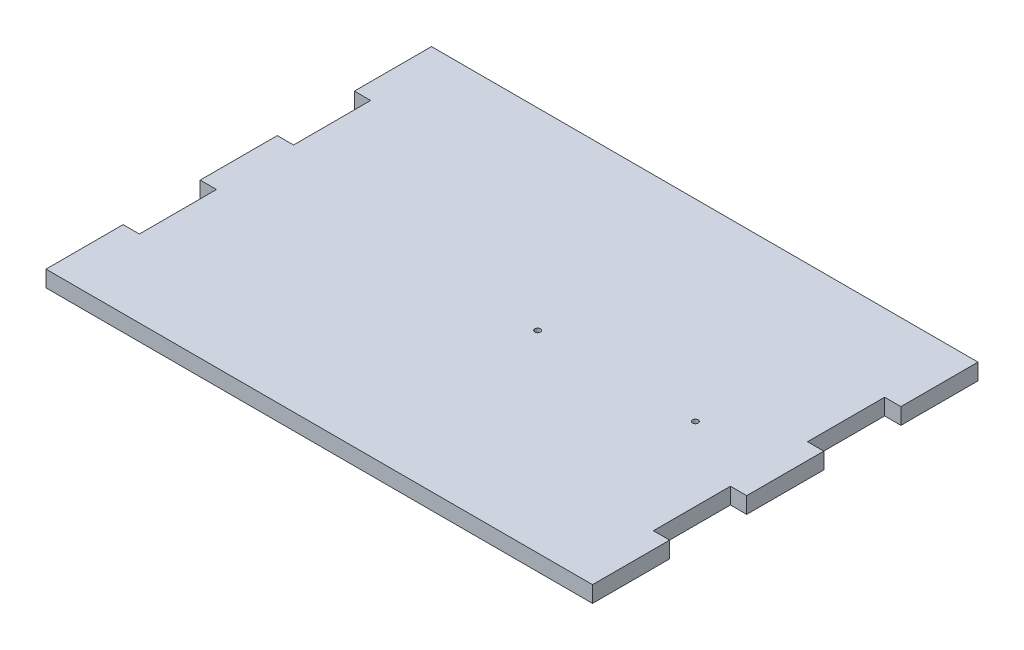
ISO-10303-21;
HEADER;
FILE_DESCRIPTION(('STEP AP214'),'2;1');
FILE_NAME('part.step','',(''),(''),'','','');
FILE_SCHEMA(('AUTOMOTIVE_DESIGN { 1 0 10303 214 1 1 1 1 }'));
ENDSEC;
DATA;
#1=APPLICATION_CONTEXT('core data for automotive mechanical design processes');
#2=APPLICATION_PROTOCOL_DEFINITION('international standard','automotive_design',2000,#1);
#3=PRODUCT_CONTEXT('',#1,'mechanical');
#4=PRODUCT('Part','Part','',(#3));
#5=PRODUCT_RELATED_PRODUCT_CATEGORY('part','',(#4));
#6=PRODUCT_DEFINITION_FORMATION('','',#4);
#7=PRODUCT_DEFINITION_CONTEXT('part definition',#1,'design');
#8=PRODUCT_DEFINITION('design','',#6,#7);
#9=PRODUCT_DEFINITION_SHAPE('','',#8);
#10=(LENGTH_UNIT() NAMED_UNIT(*) SI_UNIT(.MILLI.,.METRE.));
#11=(NAMED_UNIT(*) PLANE_ANGLE_UNIT() SI_UNIT($,.RADIAN.));
#12=(NAMED_UNIT(*) SI_UNIT($,.STERADIAN.) SOLID_ANGLE_UNIT());
#13=UNCERTAINTY_MEASURE_WITH_UNIT(LENGTH_MEASURE(1.E-05),#10,'distance_accuracy_value','');
#14=(GEOMETRIC_REPRESENTATION_CONTEXT(3) GLOBAL_UNCERTAINTY_ASSIGNED_CONTEXT((#13)) GLOBAL_UNIT_ASSIGNED_CONTEXT((#10,
#11,#12)) REPRESENTATION_CONTEXT('',''));
#15=CARTESIAN_POINT('',(0.,0.,0.));
#16=DIRECTION('',(0.,0.,1.));
#17=DIRECTION('',(1.,0.,0.));
#18=AXIS2_PLACEMENT_3D('',#15,#16,#17);
#19=CARTESIAN_POINT('',(-6.,5.7,14.));
#20=DIRECTION('',(0.,0.,-1.));
#21=DIRECTION('',(-1.,0.,0.));
#22=AXIS2_PLACEMENT_3D('',#19,#20,#21);
#23=PLANE('',#22);
#24=DIRECTION('',(0.,-1.,0.));
#25=VECTOR('',#24,1.);
#26=CARTESIAN_POINT('',(185.7,5.7,14.));
#27=LINE('',#26,#25);
#28=CARTESIAN_POINT('',(185.7,5.7,14.));
#29=VERTEX_POINT('',#28);
#30=CARTESIAN_POINT('',(185.7,0.,14.));
#31=VERTEX_POINT('',#30);
#32=EDGE_CURVE('E47',#29,#31,#27,.T.);
#33=ORIENTED_EDGE('',*,*,#32,.F.);
#34=DIRECTION('',(1.,0.,0.));
#35=VECTOR('',#34,1.);
#36=CARTESIAN_POINT('',(-6.,5.7,14.));
#37=LINE('',#36,#35);
#38=CARTESIAN_POINT('',(-5.7,5.7,14.));
#39=VERTEX_POINT('',#38);
#40=EDGE_CURVE('E314',#39,#29,#37,.T.);
#41=ORIENTED_EDGE('',*,*,#40,.F.);
#42=DIRECTION('',(0.,1.,0.));
#43=VECTOR('',#42,1.);
#44=CARTESIAN_POINT('',(-5.7,5.7,14.));
#45=LINE('',#44,#43);
#46=CARTESIAN_POINT('',(-5.7,0.,14.));
#47=VERTEX_POINT('',#46);
#48=EDGE_CURVE('E311',#47,#39,#45,.T.);
#49=ORIENTED_EDGE('',*,*,#48,.F.);
#50=DIRECTION('',(1.,0.,0.));
#51=VECTOR('',#50,1.);
#52=CARTESIAN_POINT('',(-6.,0.,14.));
#53=LINE('',#52,#51);
#54=EDGE_CURVE('E313',#47,#31,#53,.T.);
#55=ORIENTED_EDGE('',*,*,#54,.T.);
#56=EDGE_LOOP('',(#33,#41,#49,#55));
#57=FACE_BOUND('',#56,.T.);
#58=ADVANCED_FACE('F33',(#57),#23,.F.);
#59=CARTESIAN_POINT('',(-6.,5.7,-121.));
#60=DIRECTION('',(0.,0.,1.));
#61=DIRECTION('',(1.,0.,0.));
#62=AXIS2_PLACEMENT_3D('',#59,#60,#61);
#63=PLANE('',#62);
#64=DIRECTION('',(0.,1.,0.));
#65=VECTOR('',#64,1.);
#66=CARTESIAN_POINT('',(185.7,5.7,-121.));
#67=LINE('',#66,#65);
#68=CARTESIAN_POINT('',(185.7,0.,-121.));
#69=VERTEX_POINT('',#68);
#70=CARTESIAN_POINT('',(185.7,5.7,-121.));
#71=VERTEX_POINT('',#70);
#72=EDGE_CURVE('E249',#69,#71,#67,.T.);
#73=ORIENTED_EDGE('',*,*,#72,.F.);
#74=DIRECTION('',(-1.,0.,0.));
#75=VECTOR('',#74,1.);
#76=CARTESIAN_POINT('',(-6.,0.,-121.));
#77=LINE('',#76,#75);
#78=CARTESIAN_POINT('',(-5.70000000000001,0.,-121.));
#79=VERTEX_POINT('',#78);
#80=EDGE_CURVE('E55',#69,#79,#77,.T.);
#81=ORIENTED_EDGE('',*,*,#80,.T.);
#82=DIRECTION('',(0.,-1.,0.));
#83=VECTOR('',#82,1.);
#84=CARTESIAN_POINT('',(-5.70000000000001,5.7,-121.));
#85=LINE('',#84,#83);
#86=CARTESIAN_POINT('',(-5.70000000000001,5.7,-121.));
#87=VERTEX_POINT('',#86);
#88=EDGE_CURVE('E293',#87,#79,#85,.T.);
#89=ORIENTED_EDGE('',*,*,#88,.F.);
#90=DIRECTION('',(-1.,0.,0.));
#91=VECTOR('',#90,1.);
#92=CARTESIAN_POINT('',(-6.,5.7,-121.));
#93=LINE('',#92,#91);
#94=EDGE_CURVE('E40',#71,#87,#93,.T.);
#95=ORIENTED_EDGE('',*,*,#94,.F.);
#96=EDGE_LOOP('',(#73,#81,#89,#95));
#97=FACE_BOUND('',#96,.T.);
#98=ADVANCED_FACE('F376',(#97),#63,.F.);
#99=CARTESIAN_POINT('',(0.,5.7,0.));
#100=DIRECTION('',(0.,-1.,0.));
#101=DIRECTION('',(0.,0.,-1.));
#102=AXIS2_PLACEMENT_3D('',#99,#100,#101);
#103=PLANE('',#102);
#104=CARTESIAN_POINT('',(154.2,5.7,-53.5));
#105=DIRECTION('',(0.,-1.,0.));
#106=DIRECTION('',(0.,0.,-1.));
#107=AXIS2_PLACEMENT_3D('',#104,#105,#106);
#108=CIRCLE('',#107,0.999999999999998);
#109=CARTESIAN_POINT('',(154.2,5.7,-54.5));
#110=VERTEX_POINT('',#109);
#111=EDGE_CURVE('E512',#110,#110,#108,.F.);
#112=ORIENTED_EDGE('',*,*,#111,.F.);
#113=EDGE_LOOP('',(#112));
#114=FACE_BOUND('',#113,.T.);
#115=CARTESIAN_POINT('',(99.,5.7,-53.5));
#116=DIRECTION('',(0.,-1.,0.));
#117=DIRECTION('',(0.,0.,-1.));
#118=AXIS2_PLACEMENT_3D('',#115,#116,#117);
#119=CIRCLE('',#118,0.999999999999998);
#120=CARTESIAN_POINT('',(99.,5.7,-54.5));
#121=VERTEX_POINT('',#120);
#122=EDGE_CURVE('E194',#121,#121,#119,.F.);
#123=ORIENTED_EDGE('',*,*,#122,.F.);
#124=EDGE_LOOP('',(#123));
#125=FACE_BOUND('',#124,.T.);
#126=DIRECTION('',(0.,0.,1.));
#127=VECTOR('',#126,1.);
#128=CARTESIAN_POINT('',(185.7,5.7,0.));
#129=LINE('',#128,#127);
#130=CARTESIAN_POINT('',(185.7,5.7,-94.));
#131=VERTEX_POINT('',#130);
#132=EDGE_CURVE('E177',#71,#131,#129,.T.);
#133=ORIENTED_EDGE('',*,*,#132,.F.);
#134=ORIENTED_EDGE('',*,*,#94,.T.);
#135=DIRECTION('',(0.,0.,-1.));
#136=VECTOR('',#135,1.);
#137=CARTESIAN_POINT('',(-5.69999999999999,5.7,0.));
#138=LINE('',#137,#136);
#139=CARTESIAN_POINT('',(-5.70000000000001,5.7,-94.));
#140=VERTEX_POINT('',#139);
#141=EDGE_CURVE('E290',#140,#87,#138,.T.);
#142=ORIENTED_EDGE('',*,*,#141,.F.);
#143=DIRECTION('',(-1.,0.,0.));
#144=VECTOR('',#143,1.);
#145=CARTESIAN_POINT('',(0.,5.7,-94.));
#146=LINE('',#145,#144);
#147=CARTESIAN_POINT('',(0.,5.7,-94.));
#148=VERTEX_POINT('',#147);
#149=EDGE_CURVE('E295',#148,#140,#146,.T.);
#150=ORIENTED_EDGE('',*,*,#149,.F.);
#151=DIRECTION('',(0.,0.,-1.));
#152=VECTOR('',#151,1.);
#153=CARTESIAN_POINT('',(0.,5.7,0.));
#154=LINE('',#153,#152);
#155=CARTESIAN_POINT('',(0.,5.7,-67.));
#156=VERTEX_POINT('',#155);
#157=EDGE_CURVE('E297',#156,#148,#154,.T.);
#158=ORIENTED_EDGE('',*,*,#157,.F.);
#159=DIRECTION('',(1.,0.,0.));
#160=VECTOR('',#159,1.);
#161=CARTESIAN_POINT('',(0.,5.7,-67.));
#162=LINE('',#161,#160);
#163=CARTESIAN_POINT('',(-5.7,5.7,-67.));
#164=VERTEX_POINT('',#163);
#165=EDGE_CURVE('E299',#164,#156,#162,.T.);
#166=ORIENTED_EDGE('',*,*,#165,.F.);
#167=DIRECTION('',(0.,0.,-1.));
#168=VECTOR('',#167,1.);
#169=CARTESIAN_POINT('',(-5.69999999999999,5.7,0.));
#170=LINE('',#169,#168);
#171=CARTESIAN_POINT('',(-5.7,5.7,-40.));
#172=VERTEX_POINT('',#171);
#173=EDGE_CURVE('E301',#172,#164,#170,.T.);
#174=ORIENTED_EDGE('',*,*,#173,.F.);
#175=DIRECTION('',(-1.,0.,0.));
#176=VECTOR('',#175,1.);
#177=CARTESIAN_POINT('',(0.,5.7,-40.));
#178=LINE('',#177,#176);
#179=CARTESIAN_POINT('',(0.,5.7,-40.));
#180=VERTEX_POINT('',#179);
#181=EDGE_CURVE('E303',#180,#172,#178,.T.);
#182=ORIENTED_EDGE('',*,*,#181,.F.);
#183=DIRECTION('',(0.,0.,-1.));
#184=VECTOR('',#183,1.);
#185=CARTESIAN_POINT('',(0.,5.7,0.));
#186=LINE('',#185,#184);
#187=CARTESIAN_POINT('',(0.,5.7,-13.));
#188=VERTEX_POINT('',#187);
#189=EDGE_CURVE('E305',#188,#180,#186,.T.);
#190=ORIENTED_EDGE('',*,*,#189,.F.);
#191=DIRECTION('',(1.,0.,0.));
#192=VECTOR('',#191,1.);
#193=CARTESIAN_POINT('',(0.,5.7,-13.));
#194=LINE('',#193,#192);
#195=CARTESIAN_POINT('',(-5.7,5.7,-13.));
#196=VERTEX_POINT('',#195);
#197=EDGE_CURVE('E307',#196,#188,#194,.T.);
#198=ORIENTED_EDGE('',*,*,#197,.F.);
#199=DIRECTION('',(0.,0.,-1.));
#200=VECTOR('',#199,1.);
#201=CARTESIAN_POINT('',(-5.7,5.7,0.));
#202=LINE('',#201,#200);
#203=EDGE_CURVE('E309',#39,#196,#202,.T.);
#204=ORIENTED_EDGE('',*,*,#203,.F.);
#205=ORIENTED_EDGE('',*,*,#40,.T.);
#206=DIRECTION('',(0.,0.,1.));
#207=VECTOR('',#206,1.);
#208=CARTESIAN_POINT('',(185.7,5.7,3.43614026121485E-13));
#209=LINE('',#208,#207);
#210=CARTESIAN_POINT('',(185.7,5.7,-13.));
#211=VERTEX_POINT('',#210);
#212=EDGE_CURVE('E180',#211,#29,#209,.T.);
#213=ORIENTED_EDGE('',*,*,#212,.F.);
#214=DIRECTION('',(1.,0.,0.));
#215=VECTOR('',#214,1.);
#216=CARTESIAN_POINT('',(0.,5.7,-12.9999999999993));
#217=LINE('',#216,#215);
#218=CARTESIAN_POINT('',(180.,5.7,-13.));
#219=VERTEX_POINT('',#218);
#220=EDGE_CURVE('E234',#219,#211,#217,.T.);
#221=ORIENTED_EDGE('',*,*,#220,.F.);
#222=DIRECTION('',(0.,0.,1.));
#223=VECTOR('',#222,1.);
#224=CARTESIAN_POINT('',(180.,5.7,0.));
#225=LINE('',#224,#223);
#226=CARTESIAN_POINT('',(180.,5.7,-40.));
#227=VERTEX_POINT('',#226);
#228=EDGE_CURVE('E236',#227,#219,#225,.T.);
#229=ORIENTED_EDGE('',*,*,#228,.F.);
#230=DIRECTION('',(-1.,0.,0.));
#231=VECTOR('',#230,1.);
#232=CARTESIAN_POINT('',(-1.4608197692436E-13,5.7,-39.9999999999993));
#233=LINE('',#232,#231);
#234=CARTESIAN_POINT('',(185.7,5.7,-40.));
#235=VERTEX_POINT('',#234);
#236=EDGE_CURVE('E238',#235,#227,#233,.T.);
#237=ORIENTED_EDGE('',*,*,#236,.F.);
#238=DIRECTION('',(0.,0.,1.));
#239=VECTOR('',#238,1.);
#240=CARTESIAN_POINT('',(185.7,5.7,1.90896681178603E-13));
#241=LINE('',#240,#239);
#242=CARTESIAN_POINT('',(185.7,5.7,-67.));
#243=VERTEX_POINT('',#242);
#244=EDGE_CURVE('E240',#243,#235,#241,.T.);
#245=ORIENTED_EDGE('',*,*,#244,.F.);
#246=DIRECTION('',(1.,0.,0.));
#247=VECTOR('',#246,1.);
#248=CARTESIAN_POINT('',(-3.26249748464404E-13,5.7,-66.9999999999991));
#249=LINE('',#248,#247);
#250=CARTESIAN_POINT('',(180.,5.7,-67.));
#251=VERTEX_POINT('',#250);
#252=EDGE_CURVE('E242',#251,#243,#249,.T.);
#253=ORIENTED_EDGE('',*,*,#252,.F.);
#254=DIRECTION('',(0.,0.,1.));
#255=VECTOR('',#254,1.);
#256=CARTESIAN_POINT('',(180.,5.7,0.));
#257=LINE('',#256,#255);
#258=CARTESIAN_POINT('',(180.,5.7,-94.));
#259=VERTEX_POINT('',#258);
#260=EDGE_CURVE('E244',#259,#251,#257,.T.);
#261=ORIENTED_EDGE('',*,*,#260,.F.);
#262=DIRECTION('',(-1.,0.,0.));
#263=VECTOR('',#262,1.);
#264=CARTESIAN_POINT('',(-4.57723527696331E-13,5.7,-93.9999999999991));
#265=LINE('',#264,#263);
#266=EDGE_CURVE('E246',#131,#259,#265,.T.);
#267=ORIENTED_EDGE('',*,*,#266,.F.);
#268=EDGE_LOOP('',(#133,#134,#142,#150,#158,#166,#174,#182,#190,#198,#204,#205,#213,#221,#229,
#237,#245,#253,#261,#267));
#269=FACE_BOUND('',#268,.T.);
#270=ADVANCED_FACE('F330',(#114,#125,#269),#103,.F.);
#271=CARTESIAN_POINT('',(0.,0.,0.));
#272=DIRECTION('',(0.,-1.,0.));
#273=DIRECTION('',(0.,0.,-1.));
#274=AXIS2_PLACEMENT_3D('',#271,#272,#273);
#275=PLANE('',#274);
#276=CARTESIAN_POINT('',(154.2,0.,-53.5));
#277=DIRECTION('',(0.,1.,0.));
#278=DIRECTION('',(0.,0.,1.));
#279=AXIS2_PLACEMENT_3D('',#276,#277,#278);
#280=CIRCLE('',#279,0.999999999999998);
#281=CARTESIAN_POINT('',(154.2,0.,-52.5));
#282=VERTEX_POINT('',#281);
#283=EDGE_CURVE('E509',#282,#282,#280,.T.);
#284=ORIENTED_EDGE('',*,*,#283,.T.);
#285=EDGE_LOOP('',(#284));
#286=FACE_BOUND('',#285,.T.);
#287=CARTESIAN_POINT('',(99.,0.,-53.5));
#288=DIRECTION('',(0.,1.,0.));
#289=DIRECTION('',(0.,0.,1.));
#290=AXIS2_PLACEMENT_3D('',#287,#288,#289);
#291=CIRCLE('',#290,0.999999999999998);
#292=CARTESIAN_POINT('',(99.,0.,-52.5));
#293=VERTEX_POINT('',#292);
#294=EDGE_CURVE('E197',#293,#293,#291,.T.);
#295=ORIENTED_EDGE('',*,*,#294,.T.);
#296=EDGE_LOOP('',(#295));
#297=FACE_BOUND('',#296,.T.);
#298=ORIENTED_EDGE('',*,*,#80,.F.);
#299=DIRECTION('',(0.,0.,1.));
#300=VECTOR('',#299,1.);
#301=CARTESIAN_POINT('',(185.7,0.,-121.00166661523));
#302=LINE('',#301,#300);
#303=CARTESIAN_POINT('',(185.7,0.,-94.));
#304=VERTEX_POINT('',#303);
#305=EDGE_CURVE('E175',#69,#304,#302,.T.);
#306=ORIENTED_EDGE('',*,*,#305,.T.);
#307=DIRECTION('',(-1.,0.,0.));
#308=VECTOR('',#307,1.);
#309=CARTESIAN_POINT('',(185.7,0.,-94.));
#310=LINE('',#309,#308);
#311=CARTESIAN_POINT('',(180.,0.,-94.));
#312=VERTEX_POINT('',#311);
#313=EDGE_CURVE('E184',#304,#312,#310,.T.);
#314=ORIENTED_EDGE('',*,*,#313,.T.);
#315=DIRECTION('',(0.,0.,1.));
#316=VECTOR('',#315,1.);
#317=CARTESIAN_POINT('',(180.,0.,-94.));
#318=LINE('',#317,#316);
#319=CARTESIAN_POINT('',(180.,0.,-67.));
#320=VERTEX_POINT('',#319);
#321=EDGE_CURVE('E190',#312,#320,#318,.T.);
#322=ORIENTED_EDGE('',*,*,#321,.T.);
#323=DIRECTION('',(1.,0.,0.));
#324=VECTOR('',#323,1.);
#325=CARTESIAN_POINT('',(180.,0.,-67.));
#326=LINE('',#325,#324);
#327=CARTESIAN_POINT('',(185.7,0.,-67.));
#328=VERTEX_POINT('',#327);
#329=EDGE_CURVE('E202',#320,#328,#326,.T.);
#330=ORIENTED_EDGE('',*,*,#329,.T.);
#331=DIRECTION('',(0.,0.,1.));
#332=VECTOR('',#331,1.);
#333=CARTESIAN_POINT('',(185.7,0.,-67.));
#334=LINE('',#333,#332);
#335=CARTESIAN_POINT('',(185.7,0.,-40.));
#336=VERTEX_POINT('',#335);
#337=EDGE_CURVE('E205',#328,#336,#334,.T.);
#338=ORIENTED_EDGE('',*,*,#337,.T.);
#339=DIRECTION('',(-1.,0.,0.));
#340=VECTOR('',#339,1.);
#341=CARTESIAN_POINT('',(185.7,0.,-40.));
#342=LINE('',#341,#340);
#343=CARTESIAN_POINT('',(180.,0.,-40.));
#344=VERTEX_POINT('',#343);
#345=EDGE_CURVE('E208',#336,#344,#342,.T.);
#346=ORIENTED_EDGE('',*,*,#345,.T.);
#347=DIRECTION('',(0.,0.,1.));
#348=VECTOR('',#347,1.);
#349=CARTESIAN_POINT('',(180.,0.,-40.));
#350=LINE('',#349,#348);
#351=CARTESIAN_POINT('',(180.,0.,-13.));
#352=VERTEX_POINT('',#351);
#353=EDGE_CURVE('E211',#344,#352,#350,.T.);
#354=ORIENTED_EDGE('',*,*,#353,.T.);
#355=DIRECTION('',(1.,0.,0.));
#356=VECTOR('',#355,1.);
#357=CARTESIAN_POINT('',(180.,0.,-13.));
#358=LINE('',#357,#356);
#359=CARTESIAN_POINT('',(185.7,0.,-13.));
#360=VERTEX_POINT('',#359);
#361=EDGE_CURVE('E214',#352,#360,#358,.T.);
#362=ORIENTED_EDGE('',*,*,#361,.T.);
#363=DIRECTION('',(0.,0.,1.));
#364=VECTOR('',#363,1.);
#365=CARTESIAN_POINT('',(185.7,0.,-13.));
#366=LINE('',#365,#364);
#367=EDGE_CURVE('E217',#360,#31,#366,.T.);
#368=ORIENTED_EDGE('',*,*,#367,.T.);
#369=ORIENTED_EDGE('',*,*,#54,.F.);
#370=DIRECTION('',(0.,0.,-1.));
#371=VECTOR('',#370,1.);
#372=CARTESIAN_POINT('',(-5.7,0.,0.));
#373=LINE('',#372,#371);
#374=CARTESIAN_POINT('',(-5.7,0.,-13.));
#375=VERTEX_POINT('',#374);
#376=EDGE_CURVE('E11',#47,#375,#373,.T.);
#377=ORIENTED_EDGE('',*,*,#376,.T.);
#378=DIRECTION('',(1.,0.,0.));
#379=VECTOR('',#378,1.);
#380=CARTESIAN_POINT('',(0.,0.,-13.));
#381=LINE('',#380,#379);
#382=CARTESIAN_POINT('',(0.,0.,-13.));
#383=VERTEX_POINT('',#382);
#384=EDGE_CURVE('E251',#375,#383,#381,.T.);
#385=ORIENTED_EDGE('',*,*,#384,.T.);
#386=DIRECTION('',(0.,0.,-1.));
#387=VECTOR('',#386,1.);
#388=CARTESIAN_POINT('',(0.,0.,-40.));
#389=LINE('',#388,#387);
#390=CARTESIAN_POINT('',(0.,0.,-40.));
#391=VERTEX_POINT('',#390);
#392=EDGE_CURVE('E254',#383,#391,#389,.T.);
#393=ORIENTED_EDGE('',*,*,#392,.T.);
#394=DIRECTION('',(-1.,0.,0.));
#395=VECTOR('',#394,1.);
#396=CARTESIAN_POINT('',(-5.7,0.,-40.));
#397=LINE('',#396,#395);
#398=CARTESIAN_POINT('',(-5.7,0.,-40.));
#399=VERTEX_POINT('',#398);
#400=EDGE_CURVE('E257',#391,#399,#397,.T.);
#401=ORIENTED_EDGE('',*,*,#400,.T.);
#402=DIRECTION('',(0.,0.,-1.));
#403=VECTOR('',#402,1.);
#404=CARTESIAN_POINT('',(-5.7,0.,-67.));
#405=LINE('',#404,#403);
#406=CARTESIAN_POINT('',(-5.7,0.,-67.));
#407=VERTEX_POINT('',#406);
#408=EDGE_CURVE('E260',#399,#407,#405,.T.);
#409=ORIENTED_EDGE('',*,*,#408,.T.);
#410=DIRECTION('',(1.,0.,0.));
#411=VECTOR('',#410,1.);
#412=CARTESIAN_POINT('',(0.,0.,-67.));
#413=LINE('',#412,#411);
#414=CARTESIAN_POINT('',(0.,0.,-67.));
#415=VERTEX_POINT('',#414);
#416=EDGE_CURVE('E263',#407,#415,#413,.T.);
#417=ORIENTED_EDGE('',*,*,#416,.T.);
#418=DIRECTION('',(0.,0.,-1.));
#419=VECTOR('',#418,1.);
#420=CARTESIAN_POINT('',(0.,0.,-94.));
#421=LINE('',#420,#419);
#422=CARTESIAN_POINT('',(0.,0.,-94.));
#423=VERTEX_POINT('',#422);
#424=EDGE_CURVE('E266',#415,#423,#421,.T.);
#425=ORIENTED_EDGE('',*,*,#424,.T.);
#426=DIRECTION('',(-1.,0.,0.));
#427=VECTOR('',#426,1.);
#428=CARTESIAN_POINT('',(-5.70000000000001,0.,-94.));
#429=LINE('',#428,#427);
#430=CARTESIAN_POINT('',(-5.70000000000001,0.,-94.));
#431=VERTEX_POINT('',#430);
#432=EDGE_CURVE('E269',#423,#431,#429,.T.);
#433=ORIENTED_EDGE('',*,*,#432,.T.);
#434=DIRECTION('',(0.,0.,-1.));
#435=VECTOR('',#434,1.);
#436=CARTESIAN_POINT('',(-5.70000000000001,0.,-121.00166661523));
#437=LINE('',#436,#435);
#438=EDGE_CURVE('E272',#431,#79,#437,.T.);
#439=ORIENTED_EDGE('',*,*,#438,.T.);
#440=EDGE_LOOP('',(#298,#306,#314,#322,#330,#338,#346,#354,#362,#368,#369,#377,#385,#393,#401,
#409,#417,#425,#433,#439));
#441=FACE_BOUND('',#440,.T.);
#442=ADVANCED_FACE('F192',(#286,#297,#441),#275,.T.);
#443=CARTESIAN_POINT('',(-5.7,6.,-13.));
#444=DIRECTION('',(-1.,0.,0.));
#445=DIRECTION('',(0.,0.,1.));
#446=AXIS2_PLACEMENT_3D('',#443,#444,#445);
#447=PLANE('',#446);
#448=ORIENTED_EDGE('',*,*,#48,.T.);
#449=ORIENTED_EDGE('',*,*,#203,.T.);
#450=DIRECTION('',(0.,-1.,0.));
#451=VECTOR('',#450,1.);
#452=CARTESIAN_POINT('',(-5.7,6.,-13.));
#453=LINE('',#452,#451);
#454=EDGE_CURVE('E288',#196,#375,#453,.T.);
#455=ORIENTED_EDGE('',*,*,#454,.T.);
#456=ORIENTED_EDGE('',*,*,#376,.F.);
#457=EDGE_LOOP('',(#448,#449,#455,#456));
#458=FACE_BOUND('',#457,.T.);
#459=ADVANCED_FACE('F337',(#458),#447,.T.);
#460=CARTESIAN_POINT('',(0.,6.,-13.));
#461=DIRECTION('',(0.,0.,-1.));
#462=DIRECTION('',(-1.,0.,0.));
#463=AXIS2_PLACEMENT_3D('',#460,#461,#462);
#464=PLANE('',#463);
#465=ORIENTED_EDGE('',*,*,#197,.T.);
#466=DIRECTION('',(0.,-1.,0.));
#467=VECTOR('',#466,1.);
#468=CARTESIAN_POINT('',(0.,6.,-13.));
#469=LINE('',#468,#467);
#470=EDGE_CURVE('E286',#188,#383,#469,.T.);
#471=ORIENTED_EDGE('',*,*,#470,.T.);
#472=ORIENTED_EDGE('',*,*,#384,.F.);
#473=ORIENTED_EDGE('',*,*,#454,.F.);
#474=EDGE_LOOP('',(#465,#471,#472,#473));
#475=FACE_BOUND('',#474,.T.);
#476=ADVANCED_FACE('F340',(#475),#464,.T.);
#477=CARTESIAN_POINT('',(0.,6.,-40.));
#478=DIRECTION('',(-1.,0.,0.));
#479=DIRECTION('',(0.,0.,1.));
#480=AXIS2_PLACEMENT_3D('',#477,#478,#479);
#481=PLANE('',#480);
#482=ORIENTED_EDGE('',*,*,#189,.T.);
#483=DIRECTION('',(0.,-1.,0.));
#484=VECTOR('',#483,1.);
#485=CARTESIAN_POINT('',(0.,6.,-40.));
#486=LINE('',#485,#484);
#487=EDGE_CURVE('E284',#180,#391,#486,.T.);
#488=ORIENTED_EDGE('',*,*,#487,.T.);
#489=ORIENTED_EDGE('',*,*,#392,.F.);
#490=ORIENTED_EDGE('',*,*,#470,.F.);
#491=EDGE_LOOP('',(#482,#488,#489,#490));
#492=FACE_BOUND('',#491,.T.);
#493=ADVANCED_FACE('F345',(#492),#481,.T.);
#494=CARTESIAN_POINT('',(-5.7,6.,-40.));
#495=DIRECTION('',(0.,0.,1.));
#496=DIRECTION('',(1.,0.,0.));
#497=AXIS2_PLACEMENT_3D('',#494,#495,#496);
#498=PLANE('',#497);
#499=ORIENTED_EDGE('',*,*,#181,.T.);
#500=DIRECTION('',(0.,-1.,0.));
#501=VECTOR('',#500,1.);
#502=CARTESIAN_POINT('',(-5.7,6.,-40.));
#503=LINE('',#502,#501);
#504=EDGE_CURVE('E282',#172,#399,#503,.T.);
#505=ORIENTED_EDGE('',*,*,#504,.T.);
#506=ORIENTED_EDGE('',*,*,#400,.F.);
#507=ORIENTED_EDGE('',*,*,#487,.F.);
#508=EDGE_LOOP('',(#499,#505,#506,#507));
#509=FACE_BOUND('',#508,.T.);
#510=ADVANCED_FACE('F349',(#509),#498,.T.);
#511=CARTESIAN_POINT('',(-5.7,6.,-67.));
#512=DIRECTION('',(-1.,0.,0.));
#513=DIRECTION('',(0.,0.,1.));
#514=AXIS2_PLACEMENT_3D('',#511,#512,#513);
#515=PLANE('',#514);
#516=ORIENTED_EDGE('',*,*,#173,.T.);
#517=DIRECTION('',(0.,-1.,0.));
#518=VECTOR('',#517,1.);
#519=CARTESIAN_POINT('',(-5.7,6.,-67.));
#520=LINE('',#519,#518);
#521=EDGE_CURVE('E280',#164,#407,#520,.T.);
#522=ORIENTED_EDGE('',*,*,#521,.T.);
#523=ORIENTED_EDGE('',*,*,#408,.F.);
#524=ORIENTED_EDGE('',*,*,#504,.F.);
#525=EDGE_LOOP('',(#516,#522,#523,#524));
#526=FACE_BOUND('',#525,.T.);
#527=ADVANCED_FACE('F354',(#526),#515,.T.);
#528=CARTESIAN_POINT('',(0.,6.,-67.));
#529=DIRECTION('',(0.,0.,-1.));
#530=DIRECTION('',(-1.,0.,0.));
#531=AXIS2_PLACEMENT_3D('',#528,#529,#530);
#532=PLANE('',#531);
#533=ORIENTED_EDGE('',*,*,#165,.T.);
#534=DIRECTION('',(0.,-1.,0.));
#535=VECTOR('',#534,1.);
#536=CARTESIAN_POINT('',(0.,6.,-67.));
#537=LINE('',#536,#535);
#538=EDGE_CURVE('E278',#156,#415,#537,.T.);
#539=ORIENTED_EDGE('',*,*,#538,.T.);
#540=ORIENTED_EDGE('',*,*,#416,.F.);
#541=ORIENTED_EDGE('',*,*,#521,.F.);
#542=EDGE_LOOP('',(#533,#539,#540,#541));
#543=FACE_BOUND('',#542,.T.);
#544=ADVANCED_FACE('F359',(#543),#532,.T.);
#545=CARTESIAN_POINT('',(0.,6.,-94.));
#546=DIRECTION('',(-1.,0.,0.));
#547=DIRECTION('',(0.,0.,1.));
#548=AXIS2_PLACEMENT_3D('',#545,#546,#547);
#549=PLANE('',#548);
#550=ORIENTED_EDGE('',*,*,#157,.T.);
#551=DIRECTION('',(0.,-1.,0.));
#552=VECTOR('',#551,1.);
#553=CARTESIAN_POINT('',(0.,6.,-94.));
#554=LINE('',#553,#552);
#555=EDGE_CURVE('E276',#148,#423,#554,.T.);
#556=ORIENTED_EDGE('',*,*,#555,.T.);
#557=ORIENTED_EDGE('',*,*,#424,.F.);
#558=ORIENTED_EDGE('',*,*,#538,.F.);
#559=EDGE_LOOP('',(#550,#556,#557,#558));
#560=FACE_BOUND('',#559,.T.);
#561=ADVANCED_FACE('F364',(#560),#549,.T.);
#562=CARTESIAN_POINT('',(-5.70000000000001,6.,-94.));
#563=DIRECTION('',(0.,0.,1.));
#564=DIRECTION('',(1.,0.,0.));
#565=AXIS2_PLACEMENT_3D('',#562,#563,#564);
#566=PLANE('',#565);
#567=ORIENTED_EDGE('',*,*,#149,.T.);
#568=DIRECTION('',(0.,-1.,0.));
#569=VECTOR('',#568,1.);
#570=CARTESIAN_POINT('',(-5.70000000000001,6.,-94.));
#571=LINE('',#570,#569);
#572=EDGE_CURVE('E274',#140,#431,#571,.T.);
#573=ORIENTED_EDGE('',*,*,#572,.T.);
#574=ORIENTED_EDGE('',*,*,#432,.F.);
#575=ORIENTED_EDGE('',*,*,#555,.F.);
#576=EDGE_LOOP('',(#567,#573,#574,#575));
#577=FACE_BOUND('',#576,.T.);
#578=ADVANCED_FACE('F369',(#577),#566,.T.);
#579=CARTESIAN_POINT('',(-5.70000000000001,6.,-121.00166661523));
#580=DIRECTION('',(-1.,0.,0.));
#581=DIRECTION('',(0.,0.,1.));
#582=AXIS2_PLACEMENT_3D('',#579,#580,#581);
#583=PLANE('',#582);
#584=ORIENTED_EDGE('',*,*,#88,.T.);
#585=ORIENTED_EDGE('',*,*,#438,.F.);
#586=ORIENTED_EDGE('',*,*,#572,.F.);
#587=ORIENTED_EDGE('',*,*,#141,.T.);
#588=EDGE_LOOP('',(#584,#585,#586,#587));
#589=FACE_BOUND('',#588,.T.);
#590=ADVANCED_FACE('F373',(#589),#583,.T.);
#591=CARTESIAN_POINT('',(185.7,6.,-121.00166661523));
#592=DIRECTION('',(1.,0.,0.));
#593=DIRECTION('',(0.,0.,-1.));
#594=AXIS2_PLACEMENT_3D('',#591,#592,#593);
#595=PLANE('',#594);
#596=ORIENTED_EDGE('',*,*,#72,.T.);
#597=ORIENTED_EDGE('',*,*,#132,.T.);
#598=DIRECTION('',(0.,-1.,0.));
#599=VECTOR('',#598,1.);
#600=CARTESIAN_POINT('',(185.7,6.,-94.));
#601=LINE('',#600,#599);
#602=EDGE_CURVE('E171',#131,#304,#601,.T.);
#603=ORIENTED_EDGE('',*,*,#602,.T.);
#604=ORIENTED_EDGE('',*,*,#305,.F.);
#605=EDGE_LOOP('',(#596,#597,#603,#604));
#606=FACE_BOUND('',#605,.T.);
#607=ADVANCED_FACE('F173',(#606),#595,.T.);
#608=CARTESIAN_POINT('',(185.7,6.,-94.));
#609=DIRECTION('',(0.,0.,1.));
#610=DIRECTION('',(1.,0.,0.));
#611=AXIS2_PLACEMENT_3D('',#608,#609,#610);
#612=PLANE('',#611);
#613=ORIENTED_EDGE('',*,*,#266,.T.);
#614=DIRECTION('',(0.,-1.,0.));
#615=VECTOR('',#614,1.);
#616=CARTESIAN_POINT('',(180.,6.,-94.));
#617=LINE('',#616,#615);
#618=EDGE_CURVE('E181',#259,#312,#617,.T.);
#619=ORIENTED_EDGE('',*,*,#618,.T.);
#620=ORIENTED_EDGE('',*,*,#313,.F.);
#621=ORIENTED_EDGE('',*,*,#602,.F.);
#622=EDGE_LOOP('',(#613,#619,#620,#621));
#623=FACE_BOUND('',#622,.T.);
#624=ADVANCED_FACE('F185',(#623),#612,.T.);
#625=CARTESIAN_POINT('',(180.,6.,-94.));
#626=DIRECTION('',(1.,0.,0.));
#627=DIRECTION('',(0.,0.,-1.));
#628=AXIS2_PLACEMENT_3D('',#625,#626,#627);
#629=PLANE('',#628);
#630=ORIENTED_EDGE('',*,*,#260,.T.);
#631=DIRECTION('',(0.,-1.,0.));
#632=VECTOR('',#631,1.);
#633=CARTESIAN_POINT('',(180.,6.,-67.));
#634=LINE('',#633,#632);
#635=EDGE_CURVE('E229',#251,#320,#634,.T.);
#636=ORIENTED_EDGE('',*,*,#635,.T.);
#637=ORIENTED_EDGE('',*,*,#321,.F.);
#638=ORIENTED_EDGE('',*,*,#618,.F.);
#639=EDGE_LOOP('',(#630,#636,#637,#638));
#640=FACE_BOUND('',#639,.T.);
#641=ADVANCED_FACE('F380',(#640),#629,.T.);
#642=CARTESIAN_POINT('',(180.,6.,-67.));
#643=DIRECTION('',(0.,0.,-1.));
#644=DIRECTION('',(-1.,0.,0.));
#645=AXIS2_PLACEMENT_3D('',#642,#643,#644);
#646=PLANE('',#645);
#647=ORIENTED_EDGE('',*,*,#252,.T.);
#648=DIRECTION('',(0.,-1.,0.));
#649=VECTOR('',#648,1.);
#650=CARTESIAN_POINT('',(185.7,6.,-67.));
#651=LINE('',#650,#649);
#652=EDGE_CURVE('E227',#243,#328,#651,.T.);
#653=ORIENTED_EDGE('',*,*,#652,.T.);
#654=ORIENTED_EDGE('',*,*,#329,.F.);
#655=ORIENTED_EDGE('',*,*,#635,.F.);
#656=EDGE_LOOP('',(#647,#653,#654,#655));
#657=FACE_BOUND('',#656,.T.);
#658=ADVANCED_FACE('F385',(#657),#646,.T.);
#659=CARTESIAN_POINT('',(185.7,6.,-67.));
#660=DIRECTION('',(1.,0.,0.));
#661=DIRECTION('',(0.,0.,-1.));
#662=AXIS2_PLACEMENT_3D('',#659,#660,#661);
#663=PLANE('',#662);
#664=ORIENTED_EDGE('',*,*,#244,.T.);
#665=DIRECTION('',(0.,-1.,0.));
#666=VECTOR('',#665,1.);
#667=CARTESIAN_POINT('',(185.7,6.,-40.));
#668=LINE('',#667,#666);
#669=EDGE_CURVE('E225',#235,#336,#668,.T.);
#670=ORIENTED_EDGE('',*,*,#669,.T.);
#671=ORIENTED_EDGE('',*,*,#337,.F.);
#672=ORIENTED_EDGE('',*,*,#652,.F.);
#673=EDGE_LOOP('',(#664,#670,#671,#672));
#674=FACE_BOUND('',#673,.T.);
#675=ADVANCED_FACE('F389',(#674),#663,.T.);
#676=CARTESIAN_POINT('',(185.7,6.,-40.));
#677=DIRECTION('',(0.,0.,1.));
#678=DIRECTION('',(1.,0.,0.));
#679=AXIS2_PLACEMENT_3D('',#676,#677,#678);
#680=PLANE('',#679);
#681=ORIENTED_EDGE('',*,*,#236,.T.);
#682=DIRECTION('',(0.,-1.,0.));
#683=VECTOR('',#682,1.);
#684=CARTESIAN_POINT('',(180.,6.,-40.));
#685=LINE('',#684,#683);
#686=EDGE_CURVE('E223',#227,#344,#685,.T.);
#687=ORIENTED_EDGE('',*,*,#686,.T.);
#688=ORIENTED_EDGE('',*,*,#345,.F.);
#689=ORIENTED_EDGE('',*,*,#669,.F.);
#690=EDGE_LOOP('',(#681,#687,#688,#689));
#691=FACE_BOUND('',#690,.T.);
#692=ADVANCED_FACE('F394',(#691),#680,.T.);
#693=CARTESIAN_POINT('',(180.,6.,-40.));
#694=DIRECTION('',(1.,0.,0.));
#695=DIRECTION('',(0.,0.,-1.));
#696=AXIS2_PLACEMENT_3D('',#693,#694,#695);
#697=PLANE('',#696);
#698=ORIENTED_EDGE('',*,*,#228,.T.);
#699=DIRECTION('',(0.,-1.,0.));
#700=VECTOR('',#699,1.);
#701=CARTESIAN_POINT('',(180.,6.,-13.));
#702=LINE('',#701,#700);
#703=EDGE_CURVE('E221',#219,#352,#702,.T.);
#704=ORIENTED_EDGE('',*,*,#703,.T.);
#705=ORIENTED_EDGE('',*,*,#353,.F.);
#706=ORIENTED_EDGE('',*,*,#686,.F.);
#707=EDGE_LOOP('',(#698,#704,#705,#706));
#708=FACE_BOUND('',#707,.T.);
#709=ADVANCED_FACE('F398',(#708),#697,.T.);
#710=CARTESIAN_POINT('',(180.,6.,-13.));
#711=DIRECTION('',(0.,0.,-1.));
#712=DIRECTION('',(-1.,0.,0.));
#713=AXIS2_PLACEMENT_3D('',#710,#711,#712);
#714=PLANE('',#713);
#715=ORIENTED_EDGE('',*,*,#220,.T.);
#716=DIRECTION('',(0.,-1.,0.));
#717=VECTOR('',#716,1.);
#718=CARTESIAN_POINT('',(185.7,6.,-13.));
#719=LINE('',#718,#717);
#720=EDGE_CURVE('E219',#211,#360,#719,.T.);
#721=ORIENTED_EDGE('',*,*,#720,.T.);
#722=ORIENTED_EDGE('',*,*,#361,.F.);
#723=ORIENTED_EDGE('',*,*,#703,.F.);
#724=EDGE_LOOP('',(#715,#721,#722,#723));
#725=FACE_BOUND('',#724,.T.);
#726=ADVANCED_FACE('F400',(#725),#714,.T.);
#727=CARTESIAN_POINT('',(185.7,6.,-13.));
#728=DIRECTION('',(1.,0.,0.));
#729=DIRECTION('',(0.,0.,-1.));
#730=AXIS2_PLACEMENT_3D('',#727,#728,#729);
#731=PLANE('',#730);
#732=ORIENTED_EDGE('',*,*,#32,.T.);
#733=ORIENTED_EDGE('',*,*,#367,.F.);
#734=ORIENTED_EDGE('',*,*,#720,.F.);
#735=ORIENTED_EDGE('',*,*,#212,.T.);
#736=EDGE_LOOP('',(#732,#733,#734,#735));
#737=FACE_BOUND('',#736,.T.);
#738=ADVANCED_FACE('F325',(#737),#731,.T.);
#739=CARTESIAN_POINT('',(99.,33.,-53.5));
#740=DIRECTION('',(0.,-1.,0.));
#741=DIRECTION('',(0.,0.,-1.));
#742=AXIS2_PLACEMENT_3D('',#739,#740,#741);
#743=CYLINDRICAL_SURFACE('',#742,0.999999999999998);
#744=ORIENTED_EDGE('',*,*,#294,.F.);
#745=EDGE_LOOP('',(#744));
#746=FACE_BOUND('',#745,.T.);
#747=ORIENTED_EDGE('',*,*,#122,.T.);
#748=EDGE_LOOP('',(#747));
#749=FACE_BOUND('',#748,.T.);
#750=ADVANCED_FACE('F407',(#746,#749),#743,.F.);
#751=CARTESIAN_POINT('',(154.2,33.,-53.5));
#752=DIRECTION('',(0.,-1.,0.));
#753=DIRECTION('',(0.,0.,-1.));
#754=AXIS2_PLACEMENT_3D('',#751,#752,#753);
#755=CYLINDRICAL_SURFACE('',#754,0.999999999999998);
#756=ORIENTED_EDGE('',*,*,#283,.F.);
#757=EDGE_LOOP('',(#756));
#758=FACE_BOUND('',#757,.T.);
#759=ORIENTED_EDGE('',*,*,#111,.T.);
#760=EDGE_LOOP('',(#759));
#761=FACE_BOUND('',#760,.T.);
#762=ADVANCED_FACE('F492',(#758,#761),#755,.F.);
#763=CLOSED_SHELL('',(#58,#98,#270,#442,#459,#476,#493,#510,#527,#544,#561,#578,#590,#607,#624,
#641,#658,#675,#692,#709,#726,#738,#750,#762));
#764=MANIFOLD_SOLID_BREP('B2',#763);
#765=ADVANCED_BREP_SHAPE_REPRESENTATION('',(#18,#764),#14);
#766=SHAPE_DEFINITION_REPRESENTATION(#9,#765);
ENDSEC;
END-ISO-10303-21;
